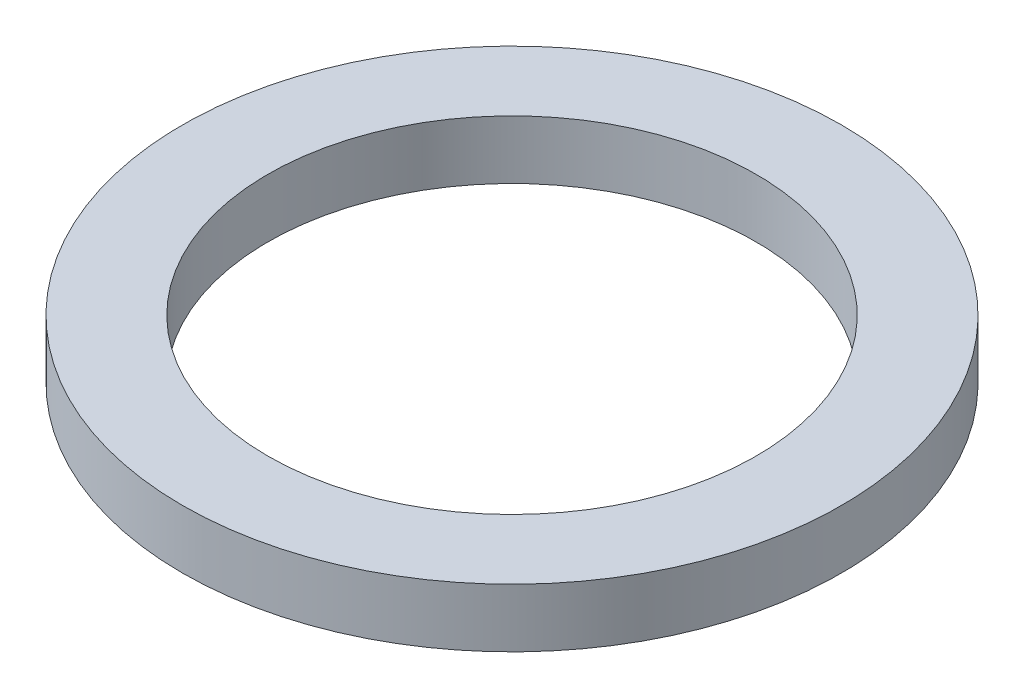
ISO-10303-21;
HEADER;
FILE_DESCRIPTION(('STEP AP214'),'2;1');
FILE_NAME('part.step','',(''),(''),'','','');
FILE_SCHEMA(('AUTOMOTIVE_DESIGN { 1 0 10303 214 1 1 1 1 }'));
ENDSEC;
DATA;
#1=APPLICATION_CONTEXT('core data for automotive mechanical design processes');
#2=APPLICATION_PROTOCOL_DEFINITION('international standard','automotive_design',2000,#1);
#3=PRODUCT_CONTEXT('',#1,'mechanical');
#4=PRODUCT('Part','Part','',(#3));
#5=PRODUCT_RELATED_PRODUCT_CATEGORY('part','',(#4));
#6=PRODUCT_DEFINITION_FORMATION('','',#4);
#7=PRODUCT_DEFINITION_CONTEXT('part definition',#1,'design');
#8=PRODUCT_DEFINITION('design','',#6,#7);
#9=PRODUCT_DEFINITION_SHAPE('','',#8);
#10=(LENGTH_UNIT() NAMED_UNIT(*) SI_UNIT(.MILLI.,.METRE.));
#11=(NAMED_UNIT(*) PLANE_ANGLE_UNIT() SI_UNIT($,.RADIAN.));
#12=(NAMED_UNIT(*) SI_UNIT($,.STERADIAN.) SOLID_ANGLE_UNIT());
#13=UNCERTAINTY_MEASURE_WITH_UNIT(LENGTH_MEASURE(1.E-05),#10,'distance_accuracy_value','');
#14=(GEOMETRIC_REPRESENTATION_CONTEXT(3) GLOBAL_UNCERTAINTY_ASSIGNED_CONTEXT((#13)) GLOBAL_UNIT_ASSIGNED_CONTEXT((#10,
#11,#12)) REPRESENTATION_CONTEXT('',''));
#15=CARTESIAN_POINT('',(0.,0.,0.));
#16=DIRECTION('',(0.,0.,1.));
#17=DIRECTION('',(1.,0.,0.));
#18=AXIS2_PLACEMENT_3D('',#15,#16,#17);
#19=CARTESIAN_POINT('',(0.,12.,0.));
#20=DIRECTION('',(0.,-1.,0.));
#21=DIRECTION('',(0.,0.,-1.));
#22=AXIS2_PLACEMENT_3D('',#19,#20,#21);
#23=CYLINDRICAL_SURFACE('',#22,67.5);
#24=CARTESIAN_POINT('',(0.,12.,0.));
#25=DIRECTION('',(0.,1.,0.));
#26=DIRECTION('',(0.,0.,1.));
#27=AXIS2_PLACEMENT_3D('',#24,#25,#26);
#28=CIRCLE('',#27,67.5);
#29=CARTESIAN_POINT('',(0.,12.,67.5));
#30=VERTEX_POINT('',#29);
#31=EDGE_CURVE('E10',#30,#30,#28,.T.);
#32=ORIENTED_EDGE('',*,*,#31,.F.);
#33=EDGE_LOOP('',(#32));
#34=FACE_BOUND('',#33,.T.);
#35=CARTESIAN_POINT('',(0.,0.,0.));
#36=DIRECTION('',(0.,1.,0.));
#37=DIRECTION('',(0.,0.,1.));
#38=AXIS2_PLACEMENT_3D('',#35,#36,#37);
#39=CIRCLE('',#38,67.5);
#40=CARTESIAN_POINT('',(0.,0.,67.5));
#41=VERTEX_POINT('',#40);
#42=EDGE_CURVE('E37',#41,#41,#39,.T.);
#43=ORIENTED_EDGE('',*,*,#42,.T.);
#44=EDGE_LOOP('',(#43));
#45=FACE_BOUND('',#44,.T.);
#46=ADVANCED_FACE('F40',(#34,#45),#23,.T.);
#47=CARTESIAN_POINT('',(0.,12.,0.));
#48=DIRECTION('',(0.,1.,0.));
#49=DIRECTION('',(0.,0.,1.));
#50=AXIS2_PLACEMENT_3D('',#47,#48,#49);
#51=PLANE('',#50);
#52=CARTESIAN_POINT('',(0.,12.,0.));
#53=DIRECTION('',(0.,1.,0.));
#54=DIRECTION('',(0.,0.,1.));
#55=AXIS2_PLACEMENT_3D('',#52,#53,#54);
#56=CIRCLE('',#55,50.);
#57=CARTESIAN_POINT('',(0.,12.,50.));
#58=VERTEX_POINT('',#57);
#59=EDGE_CURVE('E50',#58,#58,#56,.T.);
#60=ORIENTED_EDGE('',*,*,#59,.F.);
#61=EDGE_LOOP('',(#60));
#62=FACE_BOUND('',#61,.T.);
#63=ORIENTED_EDGE('',*,*,#31,.T.);
#64=EDGE_LOOP('',(#63));
#65=FACE_BOUND('',#64,.T.);
#66=ADVANCED_FACE('F59',(#62,#65),#51,.T.);
#67=CARTESIAN_POINT('',(0.,0.,0.));
#68=DIRECTION('',(0.,1.,0.));
#69=DIRECTION('',(0.,0.,1.));
#70=AXIS2_PLACEMENT_3D('',#67,#68,#69);
#71=PLANE('',#70);
#72=CARTESIAN_POINT('',(0.,0.,0.));
#73=DIRECTION('',(0.,1.,0.));
#74=DIRECTION('',(0.,0.,1.));
#75=AXIS2_PLACEMENT_3D('',#72,#73,#74);
#76=CIRCLE('',#75,50.);
#77=CARTESIAN_POINT('',(0.,0.,50.));
#78=VERTEX_POINT('',#77);
#79=EDGE_CURVE('E47',#78,#78,#76,.T.);
#80=ORIENTED_EDGE('',*,*,#79,.T.);
#81=EDGE_LOOP('',(#80));
#82=FACE_BOUND('',#81,.T.);
#83=ORIENTED_EDGE('',*,*,#42,.F.);
#84=EDGE_LOOP('',(#83));
#85=FACE_BOUND('',#84,.T.);
#86=ADVANCED_FACE('F58',(#82,#85),#71,.F.);
#87=CARTESIAN_POINT('',(0.,12.,0.));
#88=DIRECTION('',(0.,-1.,0.));
#89=DIRECTION('',(0.,0.,-1.));
#90=AXIS2_PLACEMENT_3D('',#87,#88,#89);
#91=CYLINDRICAL_SURFACE('',#90,50.);
#92=ORIENTED_EDGE('',*,*,#59,.T.);
#93=EDGE_LOOP('',(#92));
#94=FACE_BOUND('',#93,.T.);
#95=ORIENTED_EDGE('',*,*,#79,.F.);
#96=EDGE_LOOP('',(#95));
#97=FACE_BOUND('',#96,.T.);
#98=ADVANCED_FACE('F54',(#94,#97),#91,.F.);
#99=CLOSED_SHELL('',(#46,#66,#86,#98));
#100=MANIFOLD_SOLID_BREP('B2',#99);
#101=ADVANCED_BREP_SHAPE_REPRESENTATION('',(#18,#100),#14);
#102=SHAPE_DEFINITION_REPRESENTATION(#9,#101);
ENDSEC;
END-ISO-10303-21;
